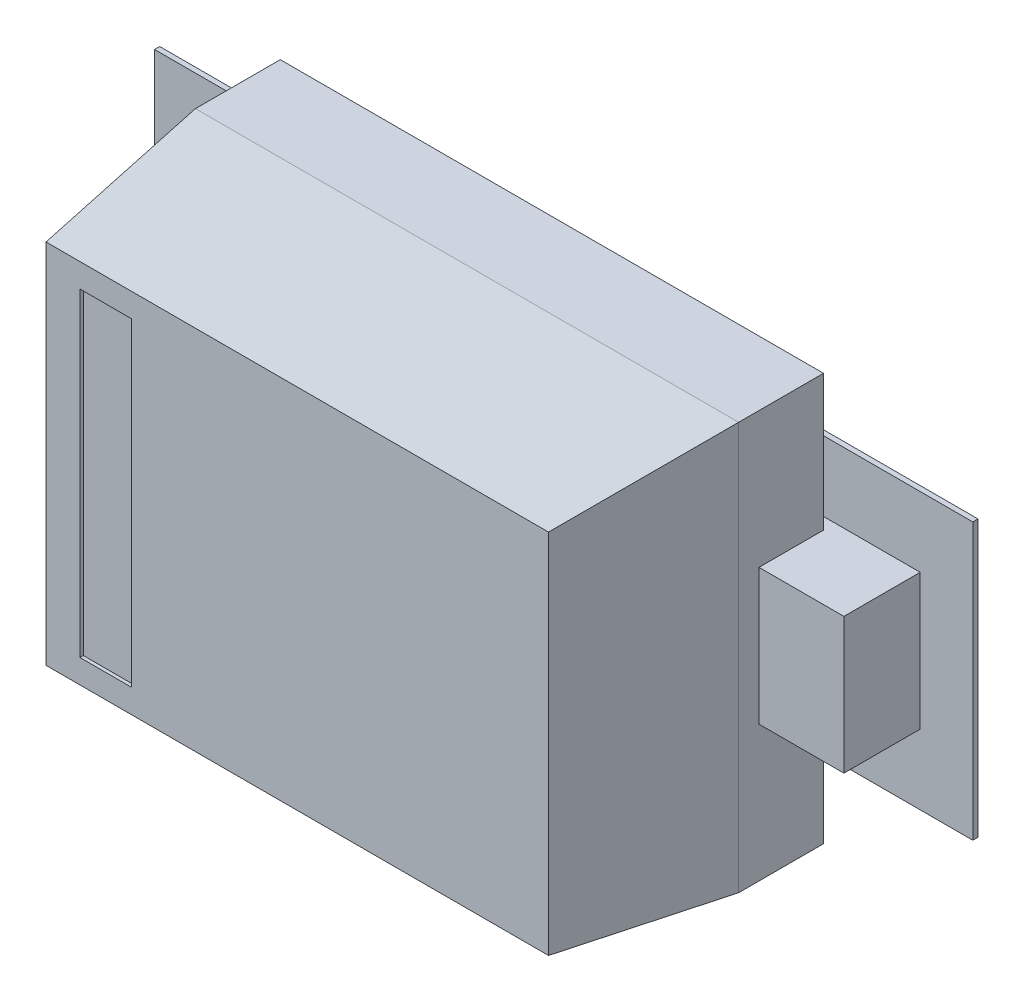
ISO-10303-21;
HEADER;
FILE_DESCRIPTION(('STEP AP214'),'2;1');
FILE_NAME('part.step','',(''),(''),'','','');
FILE_SCHEMA(('AUTOMOTIVE_DESIGN { 1 0 10303 214 1 1 1 1 }'));
ENDSEC;
DATA;
#1=APPLICATION_CONTEXT('core data for automotive mechanical design processes');
#2=APPLICATION_PROTOCOL_DEFINITION('international standard','automotive_design',2000,#1);
#3=PRODUCT_CONTEXT('',#1,'mechanical');
#4=PRODUCT('Part','Part','',(#3));
#5=PRODUCT_RELATED_PRODUCT_CATEGORY('part','',(#4));
#6=PRODUCT_DEFINITION_FORMATION('','',#4);
#7=PRODUCT_DEFINITION_CONTEXT('part definition',#1,'design');
#8=PRODUCT_DEFINITION('design','',#6,#7);
#9=PRODUCT_DEFINITION_SHAPE('','',#8);
#10=(LENGTH_UNIT() NAMED_UNIT(*) SI_UNIT(.MILLI.,.METRE.));
#11=(NAMED_UNIT(*) PLANE_ANGLE_UNIT() SI_UNIT($,.RADIAN.));
#12=(NAMED_UNIT(*) SI_UNIT($,.STERADIAN.) SOLID_ANGLE_UNIT());
#13=UNCERTAINTY_MEASURE_WITH_UNIT(LENGTH_MEASURE(1.E-05),#10,'distance_accuracy_value','');
#14=(GEOMETRIC_REPRESENTATION_CONTEXT(3) GLOBAL_UNCERTAINTY_ASSIGNED_CONTEXT((#13)) GLOBAL_UNIT_ASSIGNED_CONTEXT((#10,
#11,#12)) REPRESENTATION_CONTEXT('',''));
#15=CARTESIAN_POINT('',(0.,0.,0.));
#16=DIRECTION('',(0.,0.,1.));
#17=DIRECTION('',(1.,0.,0.));
#18=AXIS2_PLACEMENT_3D('',#15,#16,#17);
#19=CARTESIAN_POINT('',(-0.525,-0.1,0.0762));
#20=DIRECTION('',(-1.,0.,0.));
#21=DIRECTION('',(0.,0.,1.));
#22=AXIS2_PLACEMENT_3D('',#19,#20,#21);
#23=PLANE('',#22);
#24=DIRECTION('',(0.,0.,1.));
#25=VECTOR('',#24,1.);
#26=CARTESIAN_POINT('',(-0.525,-0.1,0.08382));
#27=LINE('',#26,#25);
#28=CARTESIAN_POINT('',(-0.525,-0.1,0.08382));
#29=VERTEX_POINT('',#28);
#30=CARTESIAN_POINT('',(-0.525,-0.1,0.1962));
#31=VERTEX_POINT('',#30);
#32=EDGE_CURVE('E341',#29,#31,#27,.T.);
#33=ORIENTED_EDGE('',*,*,#32,.T.);
#34=DIRECTION('',(0.,1.,0.));
#35=VECTOR('',#34,1.);
#36=CARTESIAN_POINT('',(-0.525,-0.1,0.1962));
#37=LINE('',#36,#35);
#38=CARTESIAN_POINT('',(-0.525,0.1,0.1962));
#39=VERTEX_POINT('',#38);
#40=EDGE_CURVE('E11',#31,#39,#37,.T.);
#41=ORIENTED_EDGE('',*,*,#40,.T.);
#42=DIRECTION('',(0.,0.,1.));
#43=VECTOR('',#42,1.);
#44=CARTESIAN_POINT('',(-0.525,0.1,0.08382));
#45=LINE('',#44,#43);
#46=CARTESIAN_POINT('',(-0.525,0.1,0.08382));
#47=VERTEX_POINT('',#46);
#48=EDGE_CURVE('E505',#47,#39,#45,.T.);
#49=ORIENTED_EDGE('',*,*,#48,.F.);
#50=DIRECTION('',(0.,1.,0.));
#51=VECTOR('',#50,1.);
#52=CARTESIAN_POINT('',(-0.525,-0.1,0.08382));
#53=LINE('',#52,#51);
#54=EDGE_CURVE('E469',#29,#47,#53,.T.);
#55=ORIENTED_EDGE('',*,*,#54,.F.);
#56=EDGE_LOOP('',(#33,#41,#49,#55));
#57=FACE_BOUND('',#56,.T.);
#58=ADVANCED_FACE('F17',(#57),#23,.T.);
#59=CARTESIAN_POINT('',(-0.525,-0.1,0.1962));
#60=DIRECTION('',(0.,0.,1.));
#61=DIRECTION('',(1.,0.,0.));
#62=AXIS2_PLACEMENT_3D('',#59,#60,#61);
#63=PLANE('',#62);
#64=DIRECTION('',(0.,1.,0.));
#65=VECTOR('',#64,1.);
#66=CARTESIAN_POINT('',(-0.4,-0.1,0.1962));
#67=LINE('',#66,#65);
#68=CARTESIAN_POINT('',(-0.4,-0.1,0.1962));
#69=VERTEX_POINT('',#68);
#70=CARTESIAN_POINT('',(-0.4,0.1,0.1962));
#71=VERTEX_POINT('',#70);
#72=EDGE_CURVE('E377',#69,#71,#67,.T.);
#73=ORIENTED_EDGE('',*,*,#72,.T.);
#74=DIRECTION('',(1.,0.,0.));
#75=VECTOR('',#74,1.);
#76=CARTESIAN_POINT('',(-0.525,0.1,0.1962));
#77=LINE('',#76,#75);
#78=EDGE_CURVE('E330',#39,#71,#77,.T.);
#79=ORIENTED_EDGE('',*,*,#78,.F.);
#80=ORIENTED_EDGE('',*,*,#40,.F.);
#81=DIRECTION('',(1.,0.,0.));
#82=VECTOR('',#81,1.);
#83=CARTESIAN_POINT('',(-0.525,-0.1,0.1962));
#84=LINE('',#83,#82);
#85=EDGE_CURVE('E345',#31,#69,#84,.T.);
#86=ORIENTED_EDGE('',*,*,#85,.T.);
#87=EDGE_LOOP('',(#73,#79,#80,#86));
#88=FACE_BOUND('',#87,.T.);
#89=ADVANCED_FACE('F558',(#88),#63,.T.);
#90=CARTESIAN_POINT('',(-0.325,-0.1,0.1962));
#91=DIRECTION('',(1.,0.,0.));
#92=DIRECTION('',(0.,1.,0.));
#93=AXIS2_PLACEMENT_3D('',#90,#91,#92);
#94=PLANE('',#93);
#95=DIRECTION('',(0.,0.,-1.));
#96=VECTOR('',#95,1.);
#97=CARTESIAN_POINT('',(-0.325,0.1,0.1012));
#98=LINE('',#97,#96);
#99=CARTESIAN_POINT('',(-0.325,0.1,0.1012));
#100=VERTEX_POINT('',#99);
#101=CARTESIAN_POINT('',(-0.325,0.1,0.08382));
#102=VERTEX_POINT('',#101);
#103=EDGE_CURVE('E28',#100,#102,#98,.T.);
#104=ORIENTED_EDGE('',*,*,#103,.F.);
#105=DIRECTION('',(0.,1.,0.));
#106=VECTOR('',#105,1.);
#107=CARTESIAN_POINT('',(-0.325,-0.1,0.1012));
#108=LINE('',#107,#106);
#109=CARTESIAN_POINT('',(-0.325,-0.1,0.1012));
#110=VERTEX_POINT('',#109);
#111=EDGE_CURVE('E407',#110,#100,#108,.T.);
#112=ORIENTED_EDGE('',*,*,#111,.F.);
#113=DIRECTION('',(0.,0.,-1.));
#114=VECTOR('',#113,1.);
#115=CARTESIAN_POINT('',(-0.325,-0.1,0.1012));
#116=LINE('',#115,#114);
#117=CARTESIAN_POINT('',(-0.325,-0.1,0.08382));
#118=VERTEX_POINT('',#117);
#119=EDGE_CURVE('E539',#110,#118,#116,.T.);
#120=ORIENTED_EDGE('',*,*,#119,.T.);
#121=DIRECTION('',(0.,1.,0.));
#122=VECTOR('',#121,1.);
#123=CARTESIAN_POINT('',(-0.325,-0.1,0.08382));
#124=LINE('',#123,#122);
#125=EDGE_CURVE('E524',#118,#102,#124,.T.);
#126=ORIENTED_EDGE('',*,*,#125,.T.);
#127=EDGE_LOOP('',(#104,#112,#120,#126));
#128=FACE_BOUND('',#127,.T.);
#129=ADVANCED_FACE('F627',(#128),#94,.T.);
#130=CARTESIAN_POINT('',(0.325,-0.1,0.0762));
#131=DIRECTION('',(-1.,0.,0.));
#132=DIRECTION('',(0.,0.,1.));
#133=AXIS2_PLACEMENT_3D('',#130,#131,#132);
#134=PLANE('',#133);
#135=DIRECTION('',(0.,0.,1.));
#136=VECTOR('',#135,1.);
#137=CARTESIAN_POINT('',(0.325,-0.1,0.08382));
#138=LINE('',#137,#136);
#139=CARTESIAN_POINT('',(0.325,-0.1,0.08382));
#140=VERTEX_POINT('',#139);
#141=CARTESIAN_POINT('',(0.325,-0.1,0.1012));
#142=VERTEX_POINT('',#141);
#143=EDGE_CURVE('E513',#140,#142,#138,.T.);
#144=ORIENTED_EDGE('',*,*,#143,.T.);
#145=DIRECTION('',(0.,1.,0.));
#146=VECTOR('',#145,1.);
#147=CARTESIAN_POINT('',(0.325,-0.1,0.1012));
#148=LINE('',#147,#146);
#149=CARTESIAN_POINT('',(0.325,0.1,0.1012));
#150=VERTEX_POINT('',#149);
#151=EDGE_CURVE('E367',#142,#150,#148,.T.);
#152=ORIENTED_EDGE('',*,*,#151,.T.);
#153=DIRECTION('',(0.,0.,1.));
#154=VECTOR('',#153,1.);
#155=CARTESIAN_POINT('',(0.325,0.1,0.08382));
#156=LINE('',#155,#154);
#157=CARTESIAN_POINT('',(0.325,0.1,0.08382));
#158=VERTEX_POINT('',#157);
#159=EDGE_CURVE('E502',#158,#150,#156,.T.);
#160=ORIENTED_EDGE('',*,*,#159,.F.);
#161=DIRECTION('',(0.,1.,0.));
#162=VECTOR('',#161,1.);
#163=CARTESIAN_POINT('',(0.325,-0.1,0.08382));
#164=LINE('',#163,#162);
#165=EDGE_CURVE('E333',#140,#158,#164,.T.);
#166=ORIENTED_EDGE('',*,*,#165,.F.);
#167=EDGE_LOOP('',(#144,#152,#160,#166));
#168=FACE_BOUND('',#167,.T.);
#169=ADVANCED_FACE('F633',(#168),#134,.T.);
#170=CARTESIAN_POINT('',(0.,0.1,0.));
#171=DIRECTION('',(0.,1.,0.));
#172=DIRECTION('',(1.,0.,0.));
#173=AXIS2_PLACEMENT_3D('',#170,#171,#172);
#174=PLANE('',#173);
#175=ORIENTED_EDGE('',*,*,#48,.T.);
#176=ORIENTED_EDGE('',*,*,#78,.T.);
#177=DIRECTION('',(0.,0.,1.));
#178=VECTOR('',#177,1.);
#179=CARTESIAN_POINT('',(-0.4,0.1,0.1012));
#180=LINE('',#179,#178);
#181=CARTESIAN_POINT('',(-0.4,0.1,0.1012));
#182=VERTEX_POINT('',#181);
#183=EDGE_CURVE('E458',#182,#71,#180,.T.);
#184=ORIENTED_EDGE('',*,*,#183,.F.);
#185=DIRECTION('',(1.,0.,0.));
#186=VECTOR('',#185,1.);
#187=CARTESIAN_POINT('',(-0.4,0.1,0.1012));
#188=LINE('',#187,#186);
#189=EDGE_CURVE('E411',#182,#100,#188,.T.);
#190=ORIENTED_EDGE('',*,*,#189,.T.);
#191=ORIENTED_EDGE('',*,*,#103,.T.);
#192=DIRECTION('',(-1.,0.,0.));
#193=VECTOR('',#192,1.);
#194=CARTESIAN_POINT('',(-0.325,0.1,0.08382));
#195=LINE('',#194,#193);
#196=EDGE_CURVE('E529',#102,#47,#195,.T.);
#197=ORIENTED_EDGE('',*,*,#196,.T.);
#198=EDGE_LOOP('',(#175,#176,#184,#190,#191,#197));
#199=FACE_BOUND('',#198,.T.);
#200=ADVANCED_FACE('F630',(#199),#174,.T.);
#201=CARTESIAN_POINT('',(0.,0.1,0.));
#202=DIRECTION('',(0.,1.,0.));
#203=DIRECTION('',(1.,0.,0.));
#204=AXIS2_PLACEMENT_3D('',#201,#202,#203);
#205=PLANE('',#204);
#206=ORIENTED_EDGE('',*,*,#159,.T.);
#207=DIRECTION('',(1.,0.,0.));
#208=VECTOR('',#207,1.);
#209=CARTESIAN_POINT('',(0.325,0.1,0.1012));
#210=LINE('',#209,#208);
#211=CARTESIAN_POINT('',(0.4,0.1,0.1012));
#212=VERTEX_POINT('',#211);
#213=EDGE_CURVE('E322',#150,#212,#210,.T.);
#214=ORIENTED_EDGE('',*,*,#213,.T.);
#215=DIRECTION('',(0.,0.,-1.));
#216=VECTOR('',#215,1.);
#217=CARTESIAN_POINT('',(0.4,0.1,0.1962));
#218=LINE('',#217,#216);
#219=CARTESIAN_POINT('',(0.4,0.1,0.1962));
#220=VERTEX_POINT('',#219);
#221=EDGE_CURVE('E399',#220,#212,#218,.T.);
#222=ORIENTED_EDGE('',*,*,#221,.F.);
#223=DIRECTION('',(1.,0.,0.));
#224=VECTOR('',#223,1.);
#225=CARTESIAN_POINT('',(0.4,0.1,0.1962));
#226=LINE('',#225,#224);
#227=CARTESIAN_POINT('',(0.525,0.1,0.1962));
#228=VERTEX_POINT('',#227);
#229=EDGE_CURVE('E482',#220,#228,#226,.T.);
#230=ORIENTED_EDGE('',*,*,#229,.T.);
#231=DIRECTION('',(0.,0.,-1.));
#232=VECTOR('',#231,1.);
#233=CARTESIAN_POINT('',(0.525,0.1,0.1962));
#234=LINE('',#233,#232);
#235=CARTESIAN_POINT('',(0.525,0.1,0.08382));
#236=VERTEX_POINT('',#235);
#237=EDGE_CURVE('E438',#228,#236,#234,.T.);
#238=ORIENTED_EDGE('',*,*,#237,.T.);
#239=DIRECTION('',(-1.,0.,0.));
#240=VECTOR('',#239,1.);
#241=CARTESIAN_POINT('',(0.525,0.1,0.08382));
#242=LINE('',#241,#240);
#243=EDGE_CURVE('E474',#236,#158,#242,.T.);
#244=ORIENTED_EDGE('',*,*,#243,.T.);
#245=EDGE_LOOP('',(#206,#214,#222,#230,#238,#244));
#246=FACE_BOUND('',#245,.T.);
#247=ADVANCED_FACE('F632',(#246),#205,.T.);
#248=CARTESIAN_POINT('',(0.,0.3,0.));
#249=DIRECTION('',(0.,1.,0.));
#250=DIRECTION('',(1.,0.,0.));
#251=AXIS2_PLACEMENT_3D('',#248,#249,#250);
#252=PLANE('',#251);
#253=DIRECTION('',(0.,0.,-1.));
#254=VECTOR('',#253,1.);
#255=CARTESIAN_POINT('',(0.4,0.3,0.2262));
#256=LINE('',#255,#254);
#257=CARTESIAN_POINT('',(0.4,0.3,0.2262));
#258=VERTEX_POINT('',#257);
#259=CARTESIAN_POINT('',(0.4,0.3,0.1012));
#260=VERTEX_POINT('',#259);
#261=EDGE_CURVE('E350',#258,#260,#256,.T.);
#262=ORIENTED_EDGE('',*,*,#261,.T.);
#263=DIRECTION('',(-1.,0.,0.));
#264=VECTOR('',#263,1.);
#265=CARTESIAN_POINT('',(0.4,0.3,0.1012));
#266=LINE('',#265,#264);
#267=CARTESIAN_POINT('',(-0.4,0.3,0.1012));
#268=VERTEX_POINT('',#267);
#269=EDGE_CURVE('E408',#260,#268,#266,.T.);
#270=ORIENTED_EDGE('',*,*,#269,.T.);
#271=DIRECTION('',(0.,0.,1.));
#272=VECTOR('',#271,1.);
#273=CARTESIAN_POINT('',(-0.4,0.3,0.1012));
#274=LINE('',#273,#272);
#275=CARTESIAN_POINT('',(-0.4,0.3,0.2262));
#276=VERTEX_POINT('',#275);
#277=EDGE_CURVE('E380',#268,#276,#274,.T.);
#278=ORIENTED_EDGE('',*,*,#277,.T.);
#279=DIRECTION('',(1.,0.,0.));
#280=VECTOR('',#279,1.);
#281=CARTESIAN_POINT('',(-0.4,0.3,0.2262));
#282=LINE('',#281,#280);
#283=EDGE_CURVE('E499',#276,#258,#282,.T.);
#284=ORIENTED_EDGE('',*,*,#283,.T.);
#285=EDGE_LOOP('',(#262,#270,#278,#284));
#286=FACE_BOUND('',#285,.T.);
#287=ADVANCED_FACE('F642',(#286),#252,.T.);
#288=CARTESIAN_POINT('',(0.,0.285,0.3512));
#289=DIRECTION('',(0.,0.992876838486925,0.119145220618403));
#290=DIRECTION('',(1.,0.,0.));
#291=AXIS2_PLACEMENT_3D('',#288,#289,#290);
#292=PLANE('',#291);
#293=DIRECTION('',(-0.118308451008796,0.118308451008796,-0.985903758406366));
#294=VECTOR('',#293,1.);
#295=CARTESIAN_POINT('',(-0.37,0.27,0.4762));
#296=LINE('',#295,#294);
#297=CARTESIAN_POINT('',(-0.37,0.27,0.4762));
#298=VERTEX_POINT('',#297);
#299=EDGE_CURVE('E456',#298,#276,#296,.T.);
#300=ORIENTED_EDGE('',*,*,#299,.F.);
#301=DIRECTION('',(1.,0.,0.));
#302=VECTOR('',#301,1.);
#303=CARTESIAN_POINT('',(-0.37,0.27,0.4762));
#304=LINE('',#303,#302);
#305=CARTESIAN_POINT('',(0.37,0.27,0.4762));
#306=VERTEX_POINT('',#305);
#307=EDGE_CURVE('E421',#298,#306,#304,.T.);
#308=ORIENTED_EDGE('',*,*,#307,.T.);
#309=DIRECTION('',(0.118308451008796,0.118308451008796,-0.985903758406366));
#310=VECTOR('',#309,1.);
#311=CARTESIAN_POINT('',(0.37,0.27,0.4762));
#312=LINE('',#311,#310);
#313=EDGE_CURVE('E349',#306,#258,#312,.T.);
#314=ORIENTED_EDGE('',*,*,#313,.T.);
#315=ORIENTED_EDGE('',*,*,#283,.F.);
#316=EDGE_LOOP('',(#300,#308,#314,#315));
#317=FACE_BOUND('',#316,.T.);
#318=ADVANCED_FACE('F19',(#317),#292,.T.);
#319=CARTESIAN_POINT('',(0.385,0.,0.3512));
#320=DIRECTION('',(0.992876838486925,0.,0.119145220618403));
#321=DIRECTION('',(0.,-1.,0.));
#322=AXIS2_PLACEMENT_3D('',#319,#320,#321);
#323=PLANE('',#322);
#324=ORIENTED_EDGE('',*,*,#313,.F.);
#325=DIRECTION('',(0.,-1.,0.));
#326=VECTOR('',#325,1.);
#327=CARTESIAN_POINT('',(0.37,0.27,0.4762));
#328=LINE('',#327,#326);
#329=CARTESIAN_POINT('',(0.37,-0.27,0.4762));
#330=VERTEX_POINT('',#329);
#331=EDGE_CURVE('E434',#306,#330,#328,.T.);
#332=ORIENTED_EDGE('',*,*,#331,.T.);
#333=DIRECTION('',(0.118308451008796,-0.118308451008796,-0.985903758406366));
#334=VECTOR('',#333,1.);
#335=CARTESIAN_POINT('',(0.37,-0.27,0.4762));
#336=LINE('',#335,#334);
#337=CARTESIAN_POINT('',(0.4,-0.3,0.2262));
#338=VERTEX_POINT('',#337);
#339=EDGE_CURVE('E355',#330,#338,#336,.T.);
#340=ORIENTED_EDGE('',*,*,#339,.T.);
#341=DIRECTION('',(0.,-1.,0.));
#342=VECTOR('',#341,1.);
#343=CARTESIAN_POINT('',(0.4,0.3,0.2262));
#344=LINE('',#343,#342);
#345=EDGE_CURVE('E346',#258,#338,#344,.T.);
#346=ORIENTED_EDGE('',*,*,#345,.F.);
#347=EDGE_LOOP('',(#324,#332,#340,#346));
#348=FACE_BOUND('',#347,.T.);
#349=ADVANCED_FACE('F666',(#348),#323,.T.);
#350=CARTESIAN_POINT('',(0.4,-0.3,0.4762));
#351=DIRECTION('',(1.,0.,0.));
#352=DIRECTION('',(0.,1.,0.));
#353=AXIS2_PLACEMENT_3D('',#350,#351,#352);
#354=PLANE('',#353);
#355=DIRECTION('',(0.,0.,-1.));
#356=VECTOR('',#355,1.);
#357=CARTESIAN_POINT('',(0.4,-0.3,0.2262));
#358=LINE('',#357,#356);
#359=CARTESIAN_POINT('',(0.4,-0.3,0.1012));
#360=VERTEX_POINT('',#359);
#361=EDGE_CURVE('E549',#338,#360,#358,.T.);
#362=ORIENTED_EDGE('',*,*,#361,.T.);
#363=DIRECTION('',(0.,1.,0.));
#364=VECTOR('',#363,1.);
#365=CARTESIAN_POINT('',(0.4,-0.3,0.1012));
#366=LINE('',#365,#364);
#367=CARTESIAN_POINT('',(0.4,-0.1,0.1012));
#368=VERTEX_POINT('',#367);
#369=EDGE_CURVE('E340',#360,#368,#366,.T.);
#370=ORIENTED_EDGE('',*,*,#369,.T.);
#371=DIRECTION('',(0.,0.,-1.));
#372=VECTOR('',#371,1.);
#373=CARTESIAN_POINT('',(0.4,-0.1,0.1962));
#374=LINE('',#373,#372);
#375=CARTESIAN_POINT('',(0.4,-0.1,0.1962));
#376=VERTEX_POINT('',#375);
#377=EDGE_CURVE('E510',#376,#368,#374,.T.);
#378=ORIENTED_EDGE('',*,*,#377,.F.);
#379=DIRECTION('',(0.,1.,0.));
#380=VECTOR('',#379,1.);
#381=CARTESIAN_POINT('',(0.4,-0.1,0.1962));
#382=LINE('',#381,#380);
#383=EDGE_CURVE('E485',#376,#220,#382,.T.);
#384=ORIENTED_EDGE('',*,*,#383,.T.);
#385=ORIENTED_EDGE('',*,*,#221,.T.);
#386=DIRECTION('',(0.,1.,0.));
#387=VECTOR('',#386,1.);
#388=CARTESIAN_POINT('',(0.4,0.1,0.1012));
#389=LINE('',#388,#387);
#390=EDGE_CURVE('E410',#212,#260,#389,.T.);
#391=ORIENTED_EDGE('',*,*,#390,.T.);
#392=ORIENTED_EDGE('',*,*,#261,.F.);
#393=ORIENTED_EDGE('',*,*,#345,.T.);
#394=EDGE_LOOP('',(#362,#370,#378,#384,#385,#391,#392,#393));
#395=FACE_BOUND('',#394,.T.);
#396=ADVANCED_FACE('F662',(#395),#354,.T.);
#397=CARTESIAN_POINT('',(0.325,-0.1,0.1962));
#398=DIRECTION('',(0.,0.,1.));
#399=DIRECTION('',(1.,0.,0.));
#400=AXIS2_PLACEMENT_3D('',#397,#398,#399);
#401=PLANE('',#400);
#402=DIRECTION('',(0.,1.,0.));
#403=VECTOR('',#402,1.);
#404=CARTESIAN_POINT('',(0.525,-0.1,0.1962));
#405=LINE('',#404,#403);
#406=CARTESIAN_POINT('',(0.525,-0.1,0.1962));
#407=VERTEX_POINT('',#406);
#408=EDGE_CURVE('E486',#407,#228,#405,.T.);
#409=ORIENTED_EDGE('',*,*,#408,.T.);
#410=ORIENTED_EDGE('',*,*,#229,.F.);
#411=ORIENTED_EDGE('',*,*,#383,.F.);
#412=DIRECTION('',(1.,0.,0.));
#413=VECTOR('',#412,1.);
#414=CARTESIAN_POINT('',(0.4,-0.1,0.1962));
#415=LINE('',#414,#413);
#416=EDGE_CURVE('E403',#376,#407,#415,.T.);
#417=ORIENTED_EDGE('',*,*,#416,.T.);
#418=EDGE_LOOP('',(#409,#410,#411,#417));
#419=FACE_BOUND('',#418,.T.);
#420=ADVANCED_FACE('F665',(#419),#401,.T.);
#421=CARTESIAN_POINT('',(0.525,-0.1,0.1962));
#422=DIRECTION('',(1.,0.,0.));
#423=DIRECTION('',(0.,1.,0.));
#424=AXIS2_PLACEMENT_3D('',#421,#422,#423);
#425=PLANE('',#424);
#426=ORIENTED_EDGE('',*,*,#237,.F.);
#427=ORIENTED_EDGE('',*,*,#408,.F.);
#428=DIRECTION('',(0.,0.,-1.));
#429=VECTOR('',#428,1.);
#430=CARTESIAN_POINT('',(0.525,-0.1,0.1962));
#431=LINE('',#430,#429);
#432=CARTESIAN_POINT('',(0.525,-0.1,0.08382));
#433=VERTEX_POINT('',#432);
#434=EDGE_CURVE('E339',#407,#433,#431,.T.);
#435=ORIENTED_EDGE('',*,*,#434,.T.);
#436=DIRECTION('',(0.,1.,0.));
#437=VECTOR('',#436,1.);
#438=CARTESIAN_POINT('',(0.525,-0.1,0.08382));
#439=LINE('',#438,#437);
#440=EDGE_CURVE('E478',#433,#236,#439,.T.);
#441=ORIENTED_EDGE('',*,*,#440,.T.);
#442=EDGE_LOOP('',(#426,#427,#435,#441));
#443=FACE_BOUND('',#442,.T.);
#444=ADVANCED_FACE('F700',(#443),#425,.T.);
#445=CARTESIAN_POINT('',(-0.2975102,-0.2029968,0.0762));
#446=DIRECTION('',(1.,0.,0.));
#447=DIRECTION('',(0.,1.,0.));
#448=AXIS2_PLACEMENT_3D('',#445,#446,#447);
#449=PLANE('',#448);
#450=DIRECTION('',(0.,0.,1.));
#451=VECTOR('',#450,1.);
#452=CARTESIAN_POINT('',(-0.2975102,0.2029968,0.0762));
#453=LINE('',#452,#451);
#454=CARTESIAN_POINT('',(-0.2975102,0.2029968,0.0762));
#455=VERTEX_POINT('',#454);
#456=CARTESIAN_POINT('',(-0.2975102,0.2029968,0.08382));
#457=VERTEX_POINT('',#456);
#458=EDGE_CURVE('E319',#455,#457,#453,.T.);
#459=ORIENTED_EDGE('',*,*,#458,.T.);
#460=DIRECTION('',(0.,1.,0.));
#461=VECTOR('',#460,1.);
#462=CARTESIAN_POINT('',(-0.2975102,-0.2029968,0.08382));
#463=LINE('',#462,#461);
#464=CARTESIAN_POINT('',(-0.2975102,-0.2029968,0.08382));
#465=VERTEX_POINT('',#464);
#466=EDGE_CURVE('E470',#465,#457,#463,.T.);
#467=ORIENTED_EDGE('',*,*,#466,.F.);
#468=DIRECTION('',(0.,0.,1.));
#469=VECTOR('',#468,1.);
#470=CARTESIAN_POINT('',(-0.2975102,-0.2029968,0.0762));
#471=LINE('',#470,#469);
#472=CARTESIAN_POINT('',(-0.2975102,-0.2029968,0.0762));
#473=VERTEX_POINT('',#472);
#474=EDGE_CURVE('E186',#473,#465,#471,.T.);
#475=ORIENTED_EDGE('',*,*,#474,.F.);
#476=DIRECTION('',(0.,1.,0.));
#477=VECTOR('',#476,1.);
#478=CARTESIAN_POINT('',(-0.2975102,-0.2029968,0.0762));
#479=LINE('',#478,#477);
#480=EDGE_CURVE('E303',#473,#455,#479,.T.);
#481=ORIENTED_EDGE('',*,*,#480,.T.);
#482=EDGE_LOOP('',(#459,#467,#475,#481));
#483=FACE_BOUND('',#482,.T.);
#484=ADVANCED_FACE('F703',(#483),#449,.T.);
#485=CARTESIAN_POINT('',(-0.602488,-0.2029968,0.0762));
#486=DIRECTION('',(0.,-1.,0.));
#487=DIRECTION('',(0.,0.,-1.));
#488=AXIS2_PLACEMENT_3D('',#485,#486,#487);
#489=PLANE('',#488);
#490=ORIENTED_EDGE('',*,*,#474,.T.);
#491=DIRECTION('',(1.,0.,0.));
#492=VECTOR('',#491,1.);
#493=CARTESIAN_POINT('',(-0.602488,-0.2029968,0.08382));
#494=LINE('',#493,#492);
#495=CARTESIAN_POINT('',(-0.602488,-0.2029968,0.08382));
#496=VERTEX_POINT('',#495);
#497=EDGE_CURVE('E517',#496,#465,#494,.T.);
#498=ORIENTED_EDGE('',*,*,#497,.F.);
#499=DIRECTION('',(0.,0.,1.));
#500=VECTOR('',#499,1.);
#501=CARTESIAN_POINT('',(-0.602488,-0.2029968,0.0762));
#502=LINE('',#501,#500);
#503=CARTESIAN_POINT('',(-0.602488,-0.2029968,0.0762));
#504=VERTEX_POINT('',#503);
#505=EDGE_CURVE('E479',#504,#496,#502,.T.);
#506=ORIENTED_EDGE('',*,*,#505,.F.);
#507=DIRECTION('',(1.,0.,0.));
#508=VECTOR('',#507,1.);
#509=CARTESIAN_POINT('',(-0.602488,-0.2029968,0.0762));
#510=LINE('',#509,#508);
#511=EDGE_CURVE('E393',#504,#473,#510,.T.);
#512=ORIENTED_EDGE('',*,*,#511,.T.);
#513=EDGE_LOOP('',(#490,#498,#506,#512));
#514=FACE_BOUND('',#513,.T.);
#515=ADVANCED_FACE('F705',(#514),#489,.T.);
#516=CARTESIAN_POINT('',(-0.602488,0.2029968,0.0762));
#517=DIRECTION('',(-1.,0.,0.));
#518=DIRECTION('',(0.,0.,1.));
#519=AXIS2_PLACEMENT_3D('',#516,#517,#518);
#520=PLANE('',#519);
#521=ORIENTED_EDGE('',*,*,#505,.T.);
#522=DIRECTION('',(0.,-1.,0.));
#523=VECTOR('',#522,1.);
#524=CARTESIAN_POINT('',(-0.602488,0.2029968,0.08382));
#525=LINE('',#524,#523);
#526=CARTESIAN_POINT('',(-0.602488,0.2029968,0.08382));
#527=VERTEX_POINT('',#526);
#528=EDGE_CURVE('E588',#527,#496,#525,.T.);
#529=ORIENTED_EDGE('',*,*,#528,.F.);
#530=DIRECTION('',(0.,0.,1.));
#531=VECTOR('',#530,1.);
#532=CARTESIAN_POINT('',(-0.602488,0.2029968,0.0762));
#533=LINE('',#532,#531);
#534=CARTESIAN_POINT('',(-0.602488,0.2029968,0.0762));
#535=VERTEX_POINT('',#534);
#536=EDGE_CURVE('E495',#535,#527,#533,.T.);
#537=ORIENTED_EDGE('',*,*,#536,.F.);
#538=DIRECTION('',(0.,-1.,0.));
#539=VECTOR('',#538,1.);
#540=CARTESIAN_POINT('',(-0.602488,0.2029968,0.0762));
#541=LINE('',#540,#539);
#542=EDGE_CURVE('E389',#535,#504,#541,.T.);
#543=ORIENTED_EDGE('',*,*,#542,.T.);
#544=EDGE_LOOP('',(#521,#529,#537,#543));
#545=FACE_BOUND('',#544,.T.);
#546=ADVANCED_FACE('F618',(#545),#520,.T.);
#547=CARTESIAN_POINT('',(0.2975102,0.2029968,0.0762));
#548=DIRECTION('',(-1.,0.,0.));
#549=DIRECTION('',(0.,0.,1.));
#550=AXIS2_PLACEMENT_3D('',#547,#548,#549);
#551=PLANE('',#550);
#552=DIRECTION('',(0.,0.,1.));
#553=VECTOR('',#552,1.);
#554=CARTESIAN_POINT('',(0.2975102,-0.2029968,0.0762));
#555=LINE('',#554,#553);
#556=CARTESIAN_POINT('',(0.2975102,-0.2029968,0.0762));
#557=VERTEX_POINT('',#556);
#558=CARTESIAN_POINT('',(0.2975102,-0.2029968,0.08382));
#559=VERTEX_POINT('',#558);
#560=EDGE_CURVE('E396',#557,#559,#555,.T.);
#561=ORIENTED_EDGE('',*,*,#560,.T.);
#562=DIRECTION('',(0.,-1.,0.));
#563=VECTOR('',#562,1.);
#564=CARTESIAN_POINT('',(0.2975102,0.2029968,0.08382));
#565=LINE('',#564,#563);
#566=CARTESIAN_POINT('',(0.2975102,0.2029968,0.08382));
#567=VERTEX_POINT('',#566);
#568=EDGE_CURVE('E528',#567,#559,#565,.T.);
#569=ORIENTED_EDGE('',*,*,#568,.F.);
#570=DIRECTION('',(0.,0.,1.));
#571=VECTOR('',#570,1.);
#572=CARTESIAN_POINT('',(0.2975102,0.2029968,0.0762));
#573=LINE('',#572,#571);
#574=CARTESIAN_POINT('',(0.2975102,0.2029968,0.0762));
#575=VERTEX_POINT('',#574);
#576=EDGE_CURVE('E200',#575,#567,#573,.T.);
#577=ORIENTED_EDGE('',*,*,#576,.F.);
#578=DIRECTION('',(0.,-1.,0.));
#579=VECTOR('',#578,1.);
#580=CARTESIAN_POINT('',(0.2975102,0.2029968,0.0762));
#581=LINE('',#580,#579);
#582=EDGE_CURVE('E301',#575,#557,#581,.T.);
#583=ORIENTED_EDGE('',*,*,#582,.T.);
#584=EDGE_LOOP('',(#561,#569,#577,#583));
#585=FACE_BOUND('',#584,.T.);
#586=ADVANCED_FACE('F604',(#585),#551,.T.);
#587=CARTESIAN_POINT('',(0.2975102,-0.2029968,0.0762));
#588=DIRECTION('',(0.,-1.,0.));
#589=DIRECTION('',(0.,0.,-1.));
#590=AXIS2_PLACEMENT_3D('',#587,#588,#589);
#591=PLANE('',#590);
#592=DIRECTION('',(0.,0.,1.));
#593=VECTOR('',#592,1.);
#594=CARTESIAN_POINT('',(0.602488,-0.2029968,0.0762));
#595=LINE('',#594,#593);
#596=CARTESIAN_POINT('',(0.602488,-0.2029968,0.0762));
#597=VERTEX_POINT('',#596);
#598=CARTESIAN_POINT('',(0.602488,-0.2029968,0.08382));
#599=VERTEX_POINT('',#598);
#600=EDGE_CURVE('E294',#597,#599,#595,.T.);
#601=ORIENTED_EDGE('',*,*,#600,.T.);
#602=DIRECTION('',(1.,0.,0.));
#603=VECTOR('',#602,1.);
#604=CARTESIAN_POINT('',(0.2975102,-0.2029968,0.08382));
#605=LINE('',#604,#603);
#606=EDGE_CURVE('E388',#559,#599,#605,.T.);
#607=ORIENTED_EDGE('',*,*,#606,.F.);
#608=ORIENTED_EDGE('',*,*,#560,.F.);
#609=DIRECTION('',(1.,0.,0.));
#610=VECTOR('',#609,1.);
#611=CARTESIAN_POINT('',(0.2975102,-0.2029968,0.0762));
#612=LINE('',#611,#610);
#613=EDGE_CURVE('E308',#557,#597,#612,.T.);
#614=ORIENTED_EDGE('',*,*,#613,.T.);
#615=EDGE_LOOP('',(#601,#607,#608,#614));
#616=FACE_BOUND('',#615,.T.);
#617=ADVANCED_FACE('F608',(#616),#591,.T.);
#618=CARTESIAN_POINT('',(0.602488,-0.2029968,0.0762));
#619=DIRECTION('',(1.,0.,0.));
#620=DIRECTION('',(0.,1.,0.));
#621=AXIS2_PLACEMENT_3D('',#618,#619,#620);
#622=PLANE('',#621);
#623=DIRECTION('',(0.,0.,1.));
#624=VECTOR('',#623,1.);
#625=CARTESIAN_POINT('',(0.602488,0.2029968,0.0762));
#626=LINE('',#625,#624);
#627=CARTESIAN_POINT('',(0.602488,0.2029968,0.0762));
#628=VERTEX_POINT('',#627);
#629=CARTESIAN_POINT('',(0.602488,0.2029968,0.08382));
#630=VERTEX_POINT('',#629);
#631=EDGE_CURVE('E282',#628,#630,#626,.T.);
#632=ORIENTED_EDGE('',*,*,#631,.T.);
#633=DIRECTION('',(0.,1.,0.));
#634=VECTOR('',#633,1.);
#635=CARTESIAN_POINT('',(0.602488,-0.2029968,0.08382));
#636=LINE('',#635,#634);
#637=EDGE_CURVE('E334',#599,#630,#636,.T.);
#638=ORIENTED_EDGE('',*,*,#637,.F.);
#639=ORIENTED_EDGE('',*,*,#600,.F.);
#640=DIRECTION('',(0.,1.,0.));
#641=VECTOR('',#640,1.);
#642=CARTESIAN_POINT('',(0.602488,-0.2029968,0.0762));
#643=LINE('',#642,#641);
#644=EDGE_CURVE('E300',#597,#628,#643,.T.);
#645=ORIENTED_EDGE('',*,*,#644,.T.);
#646=EDGE_LOOP('',(#632,#638,#639,#645));
#647=FACE_BOUND('',#646,.T.);
#648=ADVANCED_FACE('F305',(#647),#622,.T.);
#649=CARTESIAN_POINT('',(0.602488,0.2029968,0.0762));
#650=DIRECTION('',(0.,1.,0.));
#651=DIRECTION('',(1.,0.,0.));
#652=AXIS2_PLACEMENT_3D('',#649,#650,#651);
#653=PLANE('',#652);
#654=ORIENTED_EDGE('',*,*,#576,.T.);
#655=DIRECTION('',(-1.,0.,0.));
#656=VECTOR('',#655,1.);
#657=CARTESIAN_POINT('',(0.602488,0.2029968,0.08382));
#658=LINE('',#657,#656);
#659=EDGE_CURVE('E288',#630,#567,#658,.T.);
#660=ORIENTED_EDGE('',*,*,#659,.F.);
#661=ORIENTED_EDGE('',*,*,#631,.F.);
#662=DIRECTION('',(-1.,0.,0.));
#663=VECTOR('',#662,1.);
#664=CARTESIAN_POINT('',(0.602488,0.2029968,0.0762));
#665=LINE('',#664,#663);
#666=EDGE_CURVE('E285',#628,#575,#665,.T.);
#667=ORIENTED_EDGE('',*,*,#666,.T.);
#668=EDGE_LOOP('',(#654,#660,#661,#667));
#669=FACE_BOUND('',#668,.T.);
#670=ADVANCED_FACE('F284',(#669),#653,.T.);
#671=CARTESIAN_POINT('',(-0.325,-0.1,0.0762));
#672=DIRECTION('',(0.,0.,-1.));
#673=DIRECTION('',(0.,-1.,0.));
#674=AXIS2_PLACEMENT_3D('',#671,#672,#673);
#675=PLANE('',#674);
#676=ORIENTED_EDGE('',*,*,#480,.F.);
#677=ORIENTED_EDGE('',*,*,#511,.F.);
#678=ORIENTED_EDGE('',*,*,#542,.F.);
#679=DIRECTION('',(-1.,0.,0.));
#680=VECTOR('',#679,1.);
#681=CARTESIAN_POINT('',(-0.2975102,0.2029968,0.0762));
#682=LINE('',#681,#680);
#683=EDGE_CURVE('E21',#455,#535,#682,.T.);
#684=ORIENTED_EDGE('',*,*,#683,.F.);
#685=EDGE_LOOP('',(#676,#677,#678,#684));
#686=FACE_BOUND('',#685,.T.);
#687=ADVANCED_FACE('F636',(#686),#675,.T.);
#688=CARTESIAN_POINT('',(-0.325,-0.1,0.0762));
#689=DIRECTION('',(0.,0.,-1.));
#690=DIRECTION('',(0.,-1.,0.));
#691=AXIS2_PLACEMENT_3D('',#688,#689,#690);
#692=PLANE('',#691);
#693=ORIENTED_EDGE('',*,*,#644,.F.);
#694=ORIENTED_EDGE('',*,*,#613,.F.);
#695=ORIENTED_EDGE('',*,*,#582,.F.);
#696=ORIENTED_EDGE('',*,*,#666,.F.);
#697=EDGE_LOOP('',(#693,#694,#695,#696));
#698=FACE_BOUND('',#697,.T.);
#699=ADVANCED_FACE('F298',(#698),#692,.T.);
#700=CARTESIAN_POINT('',(-0.2975102,0.2029968,0.0762));
#701=DIRECTION('',(0.,1.,0.));
#702=DIRECTION('',(1.,0.,0.));
#703=AXIS2_PLACEMENT_3D('',#700,#701,#702);
#704=PLANE('',#703);
#705=ORIENTED_EDGE('',*,*,#536,.T.);
#706=DIRECTION('',(-1.,0.,0.));
#707=VECTOR('',#706,1.);
#708=CARTESIAN_POINT('',(-0.2975102,0.2029968,0.08382));
#709=LINE('',#708,#707);
#710=EDGE_CURVE('E465',#457,#527,#709,.T.);
#711=ORIENTED_EDGE('',*,*,#710,.F.);
#712=ORIENTED_EDGE('',*,*,#458,.F.);
#713=ORIENTED_EDGE('',*,*,#683,.T.);
#714=EDGE_LOOP('',(#705,#711,#712,#713));
#715=FACE_BOUND('',#714,.T.);
#716=ADVANCED_FACE('F644',(#715),#704,.T.);
#717=CARTESIAN_POINT('',(0.,0.,0.08382));
#718=DIRECTION('',(0.,0.,1.));
#719=DIRECTION('',(1.,0.,0.));
#720=AXIS2_PLACEMENT_3D('',#717,#718,#719);
#721=PLANE('',#720);
#722=ORIENTED_EDGE('',*,*,#165,.T.);
#723=ORIENTED_EDGE('',*,*,#243,.F.);
#724=ORIENTED_EDGE('',*,*,#440,.F.);
#725=DIRECTION('',(-1.,0.,0.));
#726=VECTOR('',#725,1.);
#727=CARTESIAN_POINT('',(0.525,-0.1,0.08382));
#728=LINE('',#727,#726);
#729=EDGE_CURVE('E535',#433,#140,#728,.T.);
#730=ORIENTED_EDGE('',*,*,#729,.T.);
#731=EDGE_LOOP('',(#722,#723,#724,#730));
#732=FACE_BOUND('',#731,.T.);
#733=ORIENTED_EDGE('',*,*,#568,.T.);
#734=ORIENTED_EDGE('',*,*,#606,.T.);
#735=ORIENTED_EDGE('',*,*,#637,.T.);
#736=ORIENTED_EDGE('',*,*,#659,.T.);
#737=EDGE_LOOP('',(#733,#734,#735,#736));
#738=FACE_BOUND('',#737,.T.);
#739=ADVANCED_FACE('F602',(#732,#738),#721,.T.);
#740=CARTESIAN_POINT('',(0.,0.,0.08382));
#741=DIRECTION('',(0.,0.,1.));
#742=DIRECTION('',(1.,0.,0.));
#743=AXIS2_PLACEMENT_3D('',#740,#741,#742);
#744=PLANE('',#743);
#745=ORIENTED_EDGE('',*,*,#54,.T.);
#746=ORIENTED_EDGE('',*,*,#196,.F.);
#747=ORIENTED_EDGE('',*,*,#125,.F.);
#748=DIRECTION('',(-1.,0.,0.));
#749=VECTOR('',#748,1.);
#750=CARTESIAN_POINT('',(-0.325,-0.1,0.08382));
#751=LINE('',#750,#749);
#752=EDGE_CURVE('E344',#118,#29,#751,.T.);
#753=ORIENTED_EDGE('',*,*,#752,.T.);
#754=EDGE_LOOP('',(#745,#746,#747,#753));
#755=FACE_BOUND('',#754,.T.);
#756=ORIENTED_EDGE('',*,*,#528,.T.);
#757=ORIENTED_EDGE('',*,*,#497,.T.);
#758=ORIENTED_EDGE('',*,*,#466,.T.);
#759=ORIENTED_EDGE('',*,*,#710,.T.);
#760=EDGE_LOOP('',(#756,#757,#758,#759));
#761=FACE_BOUND('',#760,.T.);
#762=ADVANCED_FACE('F651',(#755,#761),#744,.T.);
#763=CARTESIAN_POINT('',(0.,-0.1,0.));
#764=DIRECTION('',(0.,1.,0.));
#765=DIRECTION('',(1.,0.,0.));
#766=AXIS2_PLACEMENT_3D('',#763,#764,#765);
#767=PLANE('',#766);
#768=ORIENTED_EDGE('',*,*,#119,.F.);
#769=DIRECTION('',(1.,0.,0.));
#770=VECTOR('',#769,1.);
#771=CARTESIAN_POINT('',(-0.4,-0.1,0.1012));
#772=LINE('',#771,#770);
#773=CARTESIAN_POINT('',(-0.4,-0.1,0.1012));
#774=VERTEX_POINT('',#773);
#775=EDGE_CURVE('E335',#774,#110,#772,.T.);
#776=ORIENTED_EDGE('',*,*,#775,.F.);
#777=DIRECTION('',(0.,0.,1.));
#778=VECTOR('',#777,1.);
#779=CARTESIAN_POINT('',(-0.4,-0.1,0.1012));
#780=LINE('',#779,#778);
#781=EDGE_CURVE('E372',#774,#69,#780,.T.);
#782=ORIENTED_EDGE('',*,*,#781,.T.);
#783=ORIENTED_EDGE('',*,*,#85,.F.);
#784=ORIENTED_EDGE('',*,*,#32,.F.);
#785=ORIENTED_EDGE('',*,*,#752,.F.);
#786=EDGE_LOOP('',(#768,#776,#782,#783,#784,#785));
#787=FACE_BOUND('',#786,.T.);
#788=ADVANCED_FACE('F563',(#787),#767,.F.);
#789=CARTESIAN_POINT('',(0.,-0.1,0.));
#790=DIRECTION('',(0.,1.,0.));
#791=DIRECTION('',(1.,0.,0.));
#792=AXIS2_PLACEMENT_3D('',#789,#790,#791);
#793=PLANE('',#792);
#794=ORIENTED_EDGE('',*,*,#434,.F.);
#795=ORIENTED_EDGE('',*,*,#416,.F.);
#796=ORIENTED_EDGE('',*,*,#377,.T.);
#797=DIRECTION('',(1.,0.,0.));
#798=VECTOR('',#797,1.);
#799=CARTESIAN_POINT('',(0.325,-0.1,0.1012));
#800=LINE('',#799,#798);
#801=EDGE_CURVE('E371',#142,#368,#800,.T.);
#802=ORIENTED_EDGE('',*,*,#801,.F.);
#803=ORIENTED_EDGE('',*,*,#143,.F.);
#804=ORIENTED_EDGE('',*,*,#729,.F.);
#805=EDGE_LOOP('',(#794,#795,#796,#802,#803,#804));
#806=FACE_BOUND('',#805,.T.);
#807=ADVANCED_FACE('F650',(#806),#793,.F.);
#808=CARTESIAN_POINT('',(-0.41,-0.3302,0.1012));
#809=DIRECTION('',(0.,0.,1.));
#810=DIRECTION('',(1.,0.,0.));
#811=AXIS2_PLACEMENT_3D('',#808,#809,#810);
#812=PLANE('',#811);
#813=ORIENTED_EDGE('',*,*,#111,.T.);
#814=ORIENTED_EDGE('',*,*,#189,.F.);
#815=DIRECTION('',(0.,1.,0.));
#816=VECTOR('',#815,1.);
#817=CARTESIAN_POINT('',(-0.4,0.1,0.1012));
#818=LINE('',#817,#816);
#819=EDGE_CURVE('E384',#182,#268,#818,.T.);
#820=ORIENTED_EDGE('',*,*,#819,.T.);
#821=ORIENTED_EDGE('',*,*,#269,.F.);
#822=ORIENTED_EDGE('',*,*,#390,.F.);
#823=ORIENTED_EDGE('',*,*,#213,.F.);
#824=ORIENTED_EDGE('',*,*,#151,.F.);
#825=ORIENTED_EDGE('',*,*,#801,.T.);
#826=ORIENTED_EDGE('',*,*,#369,.F.);
#827=DIRECTION('',(-1.,0.,0.));
#828=VECTOR('',#827,1.);
#829=CARTESIAN_POINT('',(0.4,-0.3,0.1012));
#830=LINE('',#829,#828);
#831=CARTESIAN_POINT('',(-0.4,-0.3,0.1012));
#832=VERTEX_POINT('',#831);
#833=EDGE_CURVE('E448',#360,#832,#830,.T.);
#834=ORIENTED_EDGE('',*,*,#833,.T.);
#835=DIRECTION('',(0.,1.,0.));
#836=VECTOR('',#835,1.);
#837=CARTESIAN_POINT('',(-0.4,-0.3,0.1012));
#838=LINE('',#837,#836);
#839=EDGE_CURVE('E376',#832,#774,#838,.T.);
#840=ORIENTED_EDGE('',*,*,#839,.T.);
#841=ORIENTED_EDGE('',*,*,#775,.T.);
#842=EDGE_LOOP('',(#813,#814,#820,#821,#822,#823,#824,#825,#826,#834,#840,#841));
#843=FACE_BOUND('',#842,.T.);
#844=ADVANCED_FACE('F652',(#843),#812,.F.);
#845=CARTESIAN_POINT('',(-0.4,-0.3,0.0762));
#846=DIRECTION('',(-1.,0.,0.));
#847=DIRECTION('',(0.,0.,1.));
#848=AXIS2_PLACEMENT_3D('',#845,#846,#847);
#849=PLANE('',#848);
#850=DIRECTION('',(0.,-1.,0.));
#851=VECTOR('',#850,1.);
#852=CARTESIAN_POINT('',(-0.4,0.3,0.2262));
#853=LINE('',#852,#851);
#854=CARTESIAN_POINT('',(-0.4,-0.3,0.2262));
#855=VERTEX_POINT('',#854);
#856=EDGE_CURVE('E385',#276,#855,#853,.T.);
#857=ORIENTED_EDGE('',*,*,#856,.F.);
#858=ORIENTED_EDGE('',*,*,#277,.F.);
#859=ORIENTED_EDGE('',*,*,#819,.F.);
#860=ORIENTED_EDGE('',*,*,#183,.T.);
#861=ORIENTED_EDGE('',*,*,#72,.F.);
#862=ORIENTED_EDGE('',*,*,#781,.F.);
#863=ORIENTED_EDGE('',*,*,#839,.F.);
#864=DIRECTION('',(0.,0.,1.));
#865=VECTOR('',#864,1.);
#866=CARTESIAN_POINT('',(-0.4,-0.3,0.1012));
#867=LINE('',#866,#865);
#868=EDGE_CURVE('E444',#832,#855,#867,.T.);
#869=ORIENTED_EDGE('',*,*,#868,.T.);
#870=EDGE_LOOP('',(#857,#858,#859,#860,#861,#862,#863,#869));
#871=FACE_BOUND('',#870,.T.);
#872=ADVANCED_FACE('F567',(#871),#849,.T.);
#873=CARTESIAN_POINT('',(-0.385,0.,0.3512));
#874=DIRECTION('',(-0.992876838486925,0.,0.119145220618403));
#875=DIRECTION('',(0.,1.,0.));
#876=AXIS2_PLACEMENT_3D('',#873,#874,#875);
#877=PLANE('',#876);
#878=DIRECTION('',(0.,-1.,0.));
#879=VECTOR('',#878,1.);
#880=CARTESIAN_POINT('',(-0.37,0.27,0.4762));
#881=LINE('',#880,#879);
#882=CARTESIAN_POINT('',(-0.37,-0.27,0.4762));
#883=VERTEX_POINT('',#882);
#884=EDGE_CURVE('E414',#298,#883,#881,.T.);
#885=ORIENTED_EDGE('',*,*,#884,.F.);
#886=ORIENTED_EDGE('',*,*,#299,.T.);
#887=ORIENTED_EDGE('',*,*,#856,.T.);
#888=DIRECTION('',(0.118308451008796,0.118308451008796,0.985903758406366));
#889=VECTOR('',#888,1.);
#890=CARTESIAN_POINT('',(-0.4,-0.3,0.2262));
#891=LINE('',#890,#889);
#892=EDGE_CURVE('E351',#855,#883,#891,.T.);
#893=ORIENTED_EDGE('',*,*,#892,.T.);
#894=EDGE_LOOP('',(#885,#886,#887,#893));
#895=FACE_BOUND('',#894,.T.);
#896=ADVANCED_FACE('F679',(#895),#877,.T.);
#897=CARTESIAN_POINT('',(0.,-0.3,0.4712));
#898=DIRECTION('',(0.,0.,1.));
#899=DIRECTION('',(1.,0.,0.));
#900=AXIS2_PLACEMENT_3D('',#897,#898,#899);
#901=PLANE('',#900);
#902=DIRECTION('',(-1.,0.,0.));
#903=VECTOR('',#902,1.);
#904=CARTESIAN_POINT('',(-0.2438,0.235,0.4712));
#905=LINE('',#904,#903);
#906=CARTESIAN_POINT('',(-0.2438,0.235,0.4712));
#907=VERTEX_POINT('',#906);
#908=CARTESIAN_POINT('',(-0.32,0.235,0.4712));
#909=VERTEX_POINT('',#908);
#910=EDGE_CURVE('E453',#907,#909,#905,.T.);
#911=ORIENTED_EDGE('',*,*,#910,.T.);
#912=DIRECTION('',(0.,-1.,0.));
#913=VECTOR('',#912,1.);
#914=CARTESIAN_POINT('',(-0.32,0.235,0.4712));
#915=LINE('',#914,#913);
#916=CARTESIAN_POINT('',(-0.32,-0.235,0.4712));
#917=VERTEX_POINT('',#916);
#918=EDGE_CURVE('E452',#909,#917,#915,.T.);
#919=ORIENTED_EDGE('',*,*,#918,.T.);
#920=DIRECTION('',(1.,0.,0.));
#921=VECTOR('',#920,1.);
#922=CARTESIAN_POINT('',(-0.32,-0.235,0.4712));
#923=LINE('',#922,#921);
#924=CARTESIAN_POINT('',(-0.2438,-0.235,0.4712));
#925=VERTEX_POINT('',#924);
#926=EDGE_CURVE('E324',#917,#925,#923,.T.);
#927=ORIENTED_EDGE('',*,*,#926,.T.);
#928=DIRECTION('',(0.,1.,0.));
#929=VECTOR('',#928,1.);
#930=CARTESIAN_POINT('',(-0.2438,-0.235,0.4712));
#931=LINE('',#930,#929);
#932=EDGE_CURVE('E473',#925,#907,#931,.T.);
#933=ORIENTED_EDGE('',*,*,#932,.T.);
#934=EDGE_LOOP('',(#911,#919,#927,#933));
#935=FACE_BOUND('',#934,.T.);
#936=ADVANCED_FACE('F682',(#935),#901,.T.);
#937=CARTESIAN_POINT('',(-0.2438,0.235,0.4762));
#938=DIRECTION('',(0.,1.,0.));
#939=DIRECTION('',(1.,0.,0.));
#940=AXIS2_PLACEMENT_3D('',#937,#938,#939);
#941=PLANE('',#940);
#942=DIRECTION('',(0.,0.,-1.));
#943=VECTOR('',#942,1.);
#944=CARTESIAN_POINT('',(-0.32,0.235,0.4762));
#945=LINE('',#944,#943);
#946=CARTESIAN_POINT('',(-0.32,0.235,0.4762));
#947=VERTEX_POINT('',#946);
#948=EDGE_CURVE('E457',#947,#909,#945,.T.);
#949=ORIENTED_EDGE('',*,*,#948,.T.);
#950=ORIENTED_EDGE('',*,*,#910,.F.);
#951=DIRECTION('',(0.,0.,-1.));
#952=VECTOR('',#951,1.);
#953=CARTESIAN_POINT('',(-0.2438,0.235,0.4762));
#954=LINE('',#953,#952);
#955=CARTESIAN_POINT('',(-0.2438,0.235,0.4762));
#956=VERTEX_POINT('',#955);
#957=EDGE_CURVE('E443',#956,#907,#954,.T.);
#958=ORIENTED_EDGE('',*,*,#957,.F.);
#959=DIRECTION('',(-1.,0.,0.));
#960=VECTOR('',#959,1.);
#961=CARTESIAN_POINT('',(-0.2438,0.235,0.4762));
#962=LINE('',#961,#960);
#963=EDGE_CURVE('E365',#956,#947,#962,.T.);
#964=ORIENTED_EDGE('',*,*,#963,.T.);
#965=EDGE_LOOP('',(#949,#950,#958,#964));
#966=FACE_BOUND('',#965,.T.);
#967=ADVANCED_FACE('F684',(#966),#941,.F.);
#968=CARTESIAN_POINT('',(-0.32,0.235,0.4762));
#969=DIRECTION('',(-1.,0.,0.));
#970=DIRECTION('',(0.,0.,1.));
#971=AXIS2_PLACEMENT_3D('',#968,#969,#970);
#972=PLANE('',#971);
#973=DIRECTION('',(0.,0.,-1.));
#974=VECTOR('',#973,1.);
#975=CARTESIAN_POINT('',(-0.32,-0.235,0.4762));
#976=LINE('',#975,#974);
#977=CARTESIAN_POINT('',(-0.32,-0.235,0.4762));
#978=VERTEX_POINT('',#977);
#979=EDGE_CURVE('E326',#978,#917,#976,.T.);
#980=ORIENTED_EDGE('',*,*,#979,.T.);
#981=ORIENTED_EDGE('',*,*,#918,.F.);
#982=ORIENTED_EDGE('',*,*,#948,.F.);
#983=DIRECTION('',(0.,-1.,0.));
#984=VECTOR('',#983,1.);
#985=CARTESIAN_POINT('',(-0.32,0.235,0.4762));
#986=LINE('',#985,#984);
#987=EDGE_CURVE('E361',#947,#978,#986,.T.);
#988=ORIENTED_EDGE('',*,*,#987,.T.);
#989=EDGE_LOOP('',(#980,#981,#982,#988));
#990=FACE_BOUND('',#989,.T.);
#991=ADVANCED_FACE('F687',(#990),#972,.F.);
#992=CARTESIAN_POINT('',(-0.32,-0.235,0.4762));
#993=DIRECTION('',(0.,-1.,0.));
#994=DIRECTION('',(0.,0.,-1.));
#995=AXIS2_PLACEMENT_3D('',#992,#993,#994);
#996=PLANE('',#995);
#997=DIRECTION('',(0.,0.,-1.));
#998=VECTOR('',#997,1.);
#999=CARTESIAN_POINT('',(-0.2438,-0.235,0.4762));
#1000=LINE('',#999,#998);
#1001=CARTESIAN_POINT('',(-0.2438,-0.235,0.4762));
#1002=VERTEX_POINT('',#1001);
#1003=EDGE_CURVE('E327',#1002,#925,#1000,.T.);
#1004=ORIENTED_EDGE('',*,*,#1003,.T.);
#1005=ORIENTED_EDGE('',*,*,#926,.F.);
#1006=ORIENTED_EDGE('',*,*,#979,.F.);
#1007=DIRECTION('',(1.,0.,0.));
#1008=VECTOR('',#1007,1.);
#1009=CARTESIAN_POINT('',(-0.32,-0.235,0.4762));
#1010=LINE('',#1009,#1008);
#1011=EDGE_CURVE('E366',#978,#1002,#1010,.T.);
#1012=ORIENTED_EDGE('',*,*,#1011,.T.);
#1013=EDGE_LOOP('',(#1004,#1005,#1006,#1012));
#1014=FACE_BOUND('',#1013,.T.);
#1015=ADVANCED_FACE('F660',(#1014),#996,.F.);
#1016=CARTESIAN_POINT('',(-0.2438,-0.235,0.4762));
#1017=DIRECTION('',(1.,0.,0.));
#1018=DIRECTION('',(0.,1.,0.));
#1019=AXIS2_PLACEMENT_3D('',#1016,#1017,#1018);
#1020=PLANE('',#1019);
#1021=ORIENTED_EDGE('',*,*,#957,.T.);
#1022=ORIENTED_EDGE('',*,*,#932,.F.);
#1023=ORIENTED_EDGE('',*,*,#1003,.F.);
#1024=DIRECTION('',(0.,1.,0.));
#1025=VECTOR('',#1024,1.);
#1026=CARTESIAN_POINT('',(-0.2438,-0.235,0.4762));
#1027=LINE('',#1026,#1025);
#1028=EDGE_CURVE('E440',#1002,#956,#1027,.T.);
#1029=ORIENTED_EDGE('',*,*,#1028,.T.);
#1030=EDGE_LOOP('',(#1021,#1022,#1023,#1029));
#1031=FACE_BOUND('',#1030,.T.);
#1032=ADVANCED_FACE('F656',(#1031),#1020,.F.);
#1033=CARTESIAN_POINT('',(-0.4,-0.3,0.4762));
#1034=DIRECTION('',(0.,0.,1.));
#1035=DIRECTION('',(1.,0.,0.));
#1036=AXIS2_PLACEMENT_3D('',#1033,#1034,#1035);
#1037=PLANE('',#1036);
#1038=ORIENTED_EDGE('',*,*,#1011,.F.);
#1039=ORIENTED_EDGE('',*,*,#987,.F.);
#1040=ORIENTED_EDGE('',*,*,#963,.F.);
#1041=ORIENTED_EDGE('',*,*,#1028,.F.);
#1042=EDGE_LOOP('',(#1038,#1039,#1040,#1041));
#1043=FACE_BOUND('',#1042,.T.);
#1044=ORIENTED_EDGE('',*,*,#331,.F.);
#1045=ORIENTED_EDGE('',*,*,#307,.F.);
#1046=ORIENTED_EDGE('',*,*,#884,.T.);
#1047=DIRECTION('',(-1.,0.,0.));
#1048=VECTOR('',#1047,1.);
#1049=CARTESIAN_POINT('',(0.37,-0.27,0.4762));
#1050=LINE('',#1049,#1048);
#1051=EDGE_CURVE('E360',#330,#883,#1050,.T.);
#1052=ORIENTED_EDGE('',*,*,#1051,.F.);
#1053=EDGE_LOOP('',(#1044,#1045,#1046,#1052));
#1054=FACE_BOUND('',#1053,.T.);
#1055=ADVANCED_FACE('F659',(#1043,#1054),#1037,.T.);
#1056=CARTESIAN_POINT('',(0.,-0.285,0.3512));
#1057=DIRECTION('',(0.,-0.992876838486925,0.119145220618403));
#1058=DIRECTION('',(-1.,0.,0.));
#1059=AXIS2_PLACEMENT_3D('',#1056,#1057,#1058);
#1060=PLANE('',#1059);
#1061=ORIENTED_EDGE('',*,*,#892,.F.);
#1062=DIRECTION('',(-1.,0.,0.));
#1063=VECTOR('',#1062,1.);
#1064=CARTESIAN_POINT('',(0.4,-0.3,0.2262));
#1065=LINE('',#1064,#1063);
#1066=EDGE_CURVE('E356',#338,#855,#1065,.T.);
#1067=ORIENTED_EDGE('',*,*,#1066,.F.);
#1068=ORIENTED_EDGE('',*,*,#339,.F.);
#1069=ORIENTED_EDGE('',*,*,#1051,.T.);
#1070=EDGE_LOOP('',(#1061,#1067,#1068,#1069));
#1071=FACE_BOUND('',#1070,.T.);
#1072=ADVANCED_FACE('F689',(#1071),#1060,.T.);
#1073=CARTESIAN_POINT('',(0.,-0.3,0.));
#1074=DIRECTION('',(0.,1.,0.));
#1075=DIRECTION('',(1.,0.,0.));
#1076=AXIS2_PLACEMENT_3D('',#1073,#1074,#1075);
#1077=PLANE('',#1076);
#1078=ORIENTED_EDGE('',*,*,#868,.F.);
#1079=ORIENTED_EDGE('',*,*,#833,.F.);
#1080=ORIENTED_EDGE('',*,*,#361,.F.);
#1081=ORIENTED_EDGE('',*,*,#1066,.T.);
#1082=EDGE_LOOP('',(#1078,#1079,#1080,#1081));
#1083=FACE_BOUND('',#1082,.T.);
#1084=ADVANCED_FACE('F692',(#1083),#1077,.F.);
#1085=CLOSED_SHELL('',(#58,#89,#129,#169,#200,#247,#287,#318,#349,#396,#420,#444,#484,#515,#546,
#586,#617,#648,#670,#687,#699,#716,#739,#762,#788,#807,#844,#872,#896,#936,#967,#991,#1015,
#1032,#1055,#1072,#1084));
#1086=MANIFOLD_SOLID_BREP('B1',#1085);
#1087=ADVANCED_BREP_SHAPE_REPRESENTATION('',(#18,#1086),#14);
#1088=SHAPE_DEFINITION_REPRESENTATION(#9,#1087);
ENDSEC;
END-ISO-10303-21;
